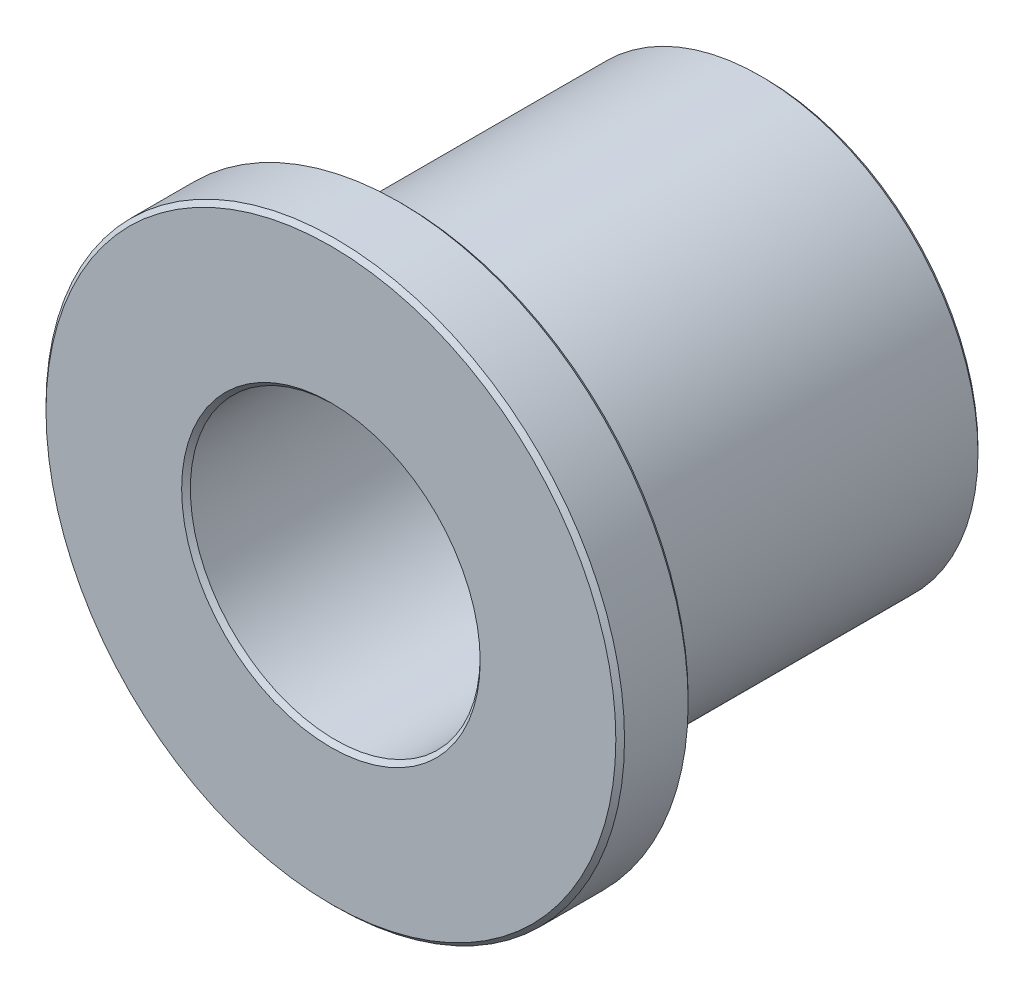
ISO-10303-21;
HEADER;
FILE_DESCRIPTION(('STEP AP214'),'2;1');
FILE_NAME('part.step','',(''),(''),'','','');
FILE_SCHEMA(('AUTOMOTIVE_DESIGN { 1 0 10303 214 1 1 1 1 }'));
ENDSEC;
DATA;
#1=APPLICATION_CONTEXT('core data for automotive mechanical design processes');
#2=APPLICATION_PROTOCOL_DEFINITION('international standard','automotive_design',2000,#1);
#3=PRODUCT_CONTEXT('',#1,'mechanical');
#4=PRODUCT('Part','Part','',(#3));
#5=PRODUCT_RELATED_PRODUCT_CATEGORY('part','',(#4));
#6=PRODUCT_DEFINITION_FORMATION('','',#4);
#7=PRODUCT_DEFINITION_CONTEXT('part definition',#1,'design');
#8=PRODUCT_DEFINITION('design','',#6,#7);
#9=PRODUCT_DEFINITION_SHAPE('','',#8);
#10=(LENGTH_UNIT() NAMED_UNIT(*) SI_UNIT(.MILLI.,.METRE.));
#11=(NAMED_UNIT(*) PLANE_ANGLE_UNIT() SI_UNIT($,.RADIAN.));
#12=(NAMED_UNIT(*) SI_UNIT($,.STERADIAN.) SOLID_ANGLE_UNIT());
#13=UNCERTAINTY_MEASURE_WITH_UNIT(LENGTH_MEASURE(1.E-05),#10,'distance_accuracy_value','');
#14=(GEOMETRIC_REPRESENTATION_CONTEXT(3) GLOBAL_UNCERTAINTY_ASSIGNED_CONTEXT((#13)) GLOBAL_UNIT_ASSIGNED_CONTEXT((#10,
#11,#12)) REPRESENTATION_CONTEXT('',''));
#15=CARTESIAN_POINT('',(0.,0.,0.));
#16=DIRECTION('',(0.,0.,1.));
#17=DIRECTION('',(1.,0.,0.));
#18=AXIS2_PLACEMENT_3D('',#15,#16,#17);
#19=CARTESIAN_POINT('',(0.,0.,6.35));
#20=DIRECTION('',(0.,0.,1.));
#21=DIRECTION('',(1.,0.,0.));
#22=AXIS2_PLACEMENT_3D('',#19,#20,#21);
#23=CYLINDRICAL_SURFACE('',#22,12.7);
#24=CARTESIAN_POINT('',(0.,0.,9.33411899999999));
#25=DIRECTION('',(0.,0.,1.));
#26=DIRECTION('',(1.,0.,0.));
#27=AXIS2_PLACEMENT_3D('',#24,#25,#26);
#28=CIRCLE('',#27,12.7);
#29=CARTESIAN_POINT('',(12.7,0.,9.33411899999999));
#30=VERTEX_POINT('',#29);
#31=EDGE_CURVE('E58',#30,#30,#28,.F.);
#32=ORIENTED_EDGE('',*,*,#31,.T.);
#33=EDGE_LOOP('',(#32));
#34=FACE_BOUND('',#33,.T.);
#35=CARTESIAN_POINT('',(0.,0.,6.540881));
#36=DIRECTION('',(0.,0.,1.));
#37=DIRECTION('',(1.,0.,0.));
#38=AXIS2_PLACEMENT_3D('',#35,#36,#37);
#39=CIRCLE('',#38,12.7);
#40=CARTESIAN_POINT('',(12.7,0.,6.540881));
#41=VERTEX_POINT('',#40);
#42=EDGE_CURVE('E61',#41,#41,#39,.T.);
#43=ORIENTED_EDGE('',*,*,#42,.T.);
#44=EDGE_LOOP('',(#43));
#45=FACE_BOUND('',#44,.T.);
#46=ADVANCED_FACE('F32',(#34,#45),#23,.T.);
#47=CARTESIAN_POINT('',(0.,0.,6.35));
#48=DIRECTION('',(0.,0.,1.));
#49=DIRECTION('',(1.,0.,0.));
#50=AXIS2_PLACEMENT_3D('',#47,#48,#49);
#51=PLANE('',#50);
#52=CARTESIAN_POINT('',(0.,0.,6.35));
#53=DIRECTION('',(0.,0.,1.));
#54=DIRECTION('',(1.,0.,0.));
#55=AXIS2_PLACEMENT_3D('',#52,#53,#54);
#56=CIRCLE('',#55,12.509119);
#57=CARTESIAN_POINT('',(12.509119,0.,6.35));
#58=VERTEX_POINT('',#57);
#59=EDGE_CURVE('E52',#58,#58,#56,.F.);
#60=ORIENTED_EDGE('',*,*,#59,.T.);
#61=EDGE_LOOP('',(#60));
#62=FACE_BOUND('',#61,.T.);
#63=CARTESIAN_POINT('',(0.,0.,6.35));
#64=DIRECTION('',(0.,0.,1.));
#65=DIRECTION('',(1.,0.,0.));
#66=AXIS2_PLACEMENT_3D('',#63,#64,#65);
#67=CIRCLE('',#66,9.741281);
#68=CARTESIAN_POINT('',(9.741281,0.,6.35));
#69=VERTEX_POINT('',#68);
#70=EDGE_CURVE('E55',#69,#69,#67,.T.);
#71=ORIENTED_EDGE('',*,*,#70,.T.);
#72=EDGE_LOOP('',(#71));
#73=FACE_BOUND('',#72,.T.);
#74=ADVANCED_FACE('F92',(#62,#73),#51,.F.);
#75=CARTESIAN_POINT('',(0.,0.,9.525));
#76=DIRECTION('',(0.,0.,1.));
#77=DIRECTION('',(1.,0.,0.));
#78=AXIS2_PLACEMENT_3D('',#75,#76,#77);
#79=PLANE('',#78);
#80=CARTESIAN_POINT('',(0.,0.,9.525));
#81=DIRECTION('',(0.,0.,1.));
#82=DIRECTION('',(1.,0.,0.));
#83=AXIS2_PLACEMENT_3D('',#80,#81,#82);
#84=CIRCLE('',#83,6.553581);
#85=CARTESIAN_POINT('',(6.553581,0.,9.525));
#86=VERTEX_POINT('',#85);
#87=EDGE_CURVE('E64',#86,#86,#84,.F.);
#88=ORIENTED_EDGE('',*,*,#87,.T.);
#89=EDGE_LOOP('',(#88));
#90=FACE_BOUND('',#89,.T.);
#91=CARTESIAN_POINT('',(0.,0.,9.525));
#92=DIRECTION('',(0.,0.,1.));
#93=DIRECTION('',(1.,0.,0.));
#94=AXIS2_PLACEMENT_3D('',#91,#92,#93);
#95=CIRCLE('',#94,12.509119);
#96=CARTESIAN_POINT('',(12.509119,0.,9.525));
#97=VERTEX_POINT('',#96);
#98=EDGE_CURVE('E67',#97,#97,#95,.T.);
#99=ORIENTED_EDGE('',*,*,#98,.T.);
#100=EDGE_LOOP('',(#99));
#101=FACE_BOUND('',#100,.T.);
#102=ADVANCED_FACE('F98',(#90,#101),#79,.T.);
#103=CARTESIAN_POINT('',(0.,0.,6.35));
#104=DIRECTION('',(0.,0.,1.));
#105=DIRECTION('',(1.,0.,0.));
#106=AXIS2_PLACEMENT_3D('',#103,#104,#105);
#107=CYLINDRICAL_SURFACE('',#106,6.3627);
#108=CARTESIAN_POINT('',(0.,0.,9.33411899999999));
#109=DIRECTION('',(0.,0.,1.));
#110=DIRECTION('',(1.,0.,0.));
#111=AXIS2_PLACEMENT_3D('',#108,#109,#110);
#112=CIRCLE('',#111,6.3627);
#113=CARTESIAN_POINT('',(6.3627,0.,9.33411899999999));
#114=VERTEX_POINT('',#113);
#115=EDGE_CURVE('E70',#114,#114,#112,.T.);
#116=ORIENTED_EDGE('',*,*,#115,.T.);
#117=EDGE_LOOP('',(#116));
#118=FACE_BOUND('',#117,.T.);
#119=CARTESIAN_POINT('',(0.,0.,-9.334119));
#120=DIRECTION('',(0.,0.,1.));
#121=DIRECTION('',(1.,0.,0.));
#122=AXIS2_PLACEMENT_3D('',#119,#120,#121);
#123=CIRCLE('',#122,6.3627);
#124=CARTESIAN_POINT('',(6.3627,0.,-9.334119));
#125=VERTEX_POINT('',#124);
#126=EDGE_CURVE('E73',#125,#125,#123,.F.);
#127=ORIENTED_EDGE('',*,*,#126,.T.);
#128=EDGE_LOOP('',(#127));
#129=FACE_BOUND('',#128,.T.);
#130=ADVANCED_FACE('F77',(#118,#129),#107,.F.);
#131=CARTESIAN_POINT('',(0.,0.,-9.525));
#132=DIRECTION('',(0.,0.,1.));
#133=DIRECTION('',(1.,0.,0.));
#134=AXIS2_PLACEMENT_3D('',#131,#132,#133);
#135=CYLINDRICAL_SURFACE('',#134,9.5504);
#136=CARTESIAN_POINT('',(0.,0.,6.15911899999999));
#137=DIRECTION('',(0.,0.,1.));
#138=DIRECTION('',(1.,0.,0.));
#139=AXIS2_PLACEMENT_3D('',#136,#137,#138);
#140=CIRCLE('',#139,9.5504);
#141=CARTESIAN_POINT('',(9.5504,0.,6.15911899999999));
#142=VERTEX_POINT('',#141);
#143=EDGE_CURVE('E43',#142,#142,#140,.F.);
#144=ORIENTED_EDGE('',*,*,#143,.T.);
#145=EDGE_LOOP('',(#144));
#146=FACE_BOUND('',#145,.T.);
#147=CARTESIAN_POINT('',(0.,0.,-9.334119));
#148=DIRECTION('',(0.,0.,1.));
#149=DIRECTION('',(1.,0.,0.));
#150=AXIS2_PLACEMENT_3D('',#147,#148,#149);
#151=CIRCLE('',#150,9.5504);
#152=CARTESIAN_POINT('',(9.5504,0.,-9.334119));
#153=VERTEX_POINT('',#152);
#154=EDGE_CURVE('E47',#153,#153,#151,.T.);
#155=ORIENTED_EDGE('',*,*,#154,.T.);
#156=EDGE_LOOP('',(#155));
#157=FACE_BOUND('',#156,.T.);
#158=ADVANCED_FACE('F160',(#146,#157),#135,.T.);
#159=CARTESIAN_POINT('',(0.,0.,-9.525));
#160=DIRECTION('',(0.,0.,1.));
#161=DIRECTION('',(1.,0.,0.));
#162=AXIS2_PLACEMENT_3D('',#159,#160,#161);
#163=PLANE('',#162);
#164=CARTESIAN_POINT('',(0.,0.,-9.525));
#165=DIRECTION('',(0.,0.,1.));
#166=DIRECTION('',(1.,0.,0.));
#167=AXIS2_PLACEMENT_3D('',#164,#165,#166);
#168=CIRCLE('',#167,6.553581);
#169=CARTESIAN_POINT('',(6.553581,0.,-9.525));
#170=VERTEX_POINT('',#169);
#171=EDGE_CURVE('E10',#170,#170,#168,.T.);
#172=ORIENTED_EDGE('',*,*,#171,.T.);
#173=EDGE_LOOP('',(#172));
#174=FACE_BOUND('',#173,.T.);
#175=CARTESIAN_POINT('',(0.,0.,-9.525));
#176=DIRECTION('',(0.,0.,1.));
#177=DIRECTION('',(1.,0.,0.));
#178=AXIS2_PLACEMENT_3D('',#175,#176,#177);
#179=CIRCLE('',#178,9.35951900000001);
#180=CARTESIAN_POINT('',(9.35951900000001,0.,-9.525));
#181=VERTEX_POINT('',#180);
#182=EDGE_CURVE('E39',#181,#181,#179,.F.);
#183=ORIENTED_EDGE('',*,*,#182,.T.);
#184=EDGE_LOOP('',(#183));
#185=FACE_BOUND('',#184,.T.);
#186=ADVANCED_FACE('F108',(#174,#185),#163,.F.);
#187=CARTESIAN_POINT('',(0.,0.,9.33411899999999));
#188=DIRECTION('',(0.,0.,1.));
#189=DIRECTION('',(1.,0.,0.));
#190=AXIS2_PLACEMENT_3D('',#187,#188,#189);
#191=CONICAL_SURFACE('',#190,6.3627,0.785398163397451);
#192=ORIENTED_EDGE('',*,*,#87,.F.);
#193=EDGE_LOOP('',(#192));
#194=FACE_BOUND('',#193,.T.);
#195=ORIENTED_EDGE('',*,*,#115,.F.);
#196=EDGE_LOOP('',(#195));
#197=FACE_BOUND('',#196,.T.);
#198=ADVANCED_FACE('F104',(#194,#197),#191,.F.);
#199=CARTESIAN_POINT('',(0.,0.,9.525));
#200=DIRECTION('',(0.,0.,-1.));
#201=DIRECTION('',(-1.,0.,0.));
#202=AXIS2_PLACEMENT_3D('',#199,#200,#201);
#203=CONICAL_SURFACE('',#202,12.509119,0.785398163397462);
#204=ORIENTED_EDGE('',*,*,#31,.F.);
#205=EDGE_LOOP('',(#204));
#206=FACE_BOUND('',#205,.T.);
#207=ORIENTED_EDGE('',*,*,#98,.F.);
#208=EDGE_LOOP('',(#207));
#209=FACE_BOUND('',#208,.T.);
#210=ADVANCED_FACE('F107',(#206,#209),#203,.T.);
#211=CARTESIAN_POINT('',(0.,0.,6.540881));
#212=DIRECTION('',(0.,0.,1.));
#213=DIRECTION('',(1.,0.,0.));
#214=AXIS2_PLACEMENT_3D('',#211,#212,#213);
#215=CONICAL_SURFACE('',#214,12.7,0.785398163397444);
#216=ORIENTED_EDGE('',*,*,#59,.F.);
#217=EDGE_LOOP('',(#216));
#218=FACE_BOUND('',#217,.T.);
#219=ORIENTED_EDGE('',*,*,#42,.F.);
#220=EDGE_LOOP('',(#219));
#221=FACE_BOUND('',#220,.T.);
#222=ADVANCED_FACE('F88',(#218,#221),#215,.T.);
#223=CARTESIAN_POINT('',(0.,0.,6.35));
#224=DIRECTION('',(0.,0.,1.));
#225=DIRECTION('',(1.,0.,0.));
#226=AXIS2_PLACEMENT_3D('',#223,#224,#225);
#227=CONICAL_SURFACE('',#226,9.741281,0.785398163397448);
#228=ORIENTED_EDGE('',*,*,#143,.F.);
#229=EDGE_LOOP('',(#228));
#230=FACE_BOUND('',#229,.T.);
#231=ORIENTED_EDGE('',*,*,#70,.F.);
#232=EDGE_LOOP('',(#231));
#233=FACE_BOUND('',#232,.T.);
#234=ADVANCED_FACE('F82',(#230,#233),#227,.T.);
#235=CARTESIAN_POINT('',(0.,0.,-9.525));
#236=DIRECTION('',(0.,0.,-1.));
#237=DIRECTION('',(-1.,0.,0.));
#238=AXIS2_PLACEMENT_3D('',#235,#236,#237);
#239=CONICAL_SURFACE('',#238,6.553581,0.785398163397446);
#240=ORIENTED_EDGE('',*,*,#126,.F.);
#241=EDGE_LOOP('',(#240));
#242=FACE_BOUND('',#241,.T.);
#243=ORIENTED_EDGE('',*,*,#171,.F.);
#244=EDGE_LOOP('',(#243));
#245=FACE_BOUND('',#244,.T.);
#246=ADVANCED_FACE('F79',(#242,#245),#239,.F.);
#247=CARTESIAN_POINT('',(0.,0.,-9.334119));
#248=DIRECTION('',(0.,0.,1.));
#249=DIRECTION('',(1.,0.,0.));
#250=AXIS2_PLACEMENT_3D('',#247,#248,#249);
#251=CONICAL_SURFACE('',#250,9.5504,0.785398163397435);
#252=ORIENTED_EDGE('',*,*,#182,.F.);
#253=EDGE_LOOP('',(#252));
#254=FACE_BOUND('',#253,.T.);
#255=ORIENTED_EDGE('',*,*,#154,.F.);
#256=EDGE_LOOP('',(#255));
#257=FACE_BOUND('',#256,.T.);
#258=ADVANCED_FACE('F34',(#254,#257),#251,.T.);
#259=CLOSED_SHELL('',(#46,#74,#102,#130,#158,#186,#198,#210,#222,#234,#246,#258));
#260=MANIFOLD_SOLID_BREP('B2',#259);
#261=ADVANCED_BREP_SHAPE_REPRESENTATION('',(#18,#260),#14);
#262=SHAPE_DEFINITION_REPRESENTATION(#9,#261);
ENDSEC;
END-ISO-10303-21;
